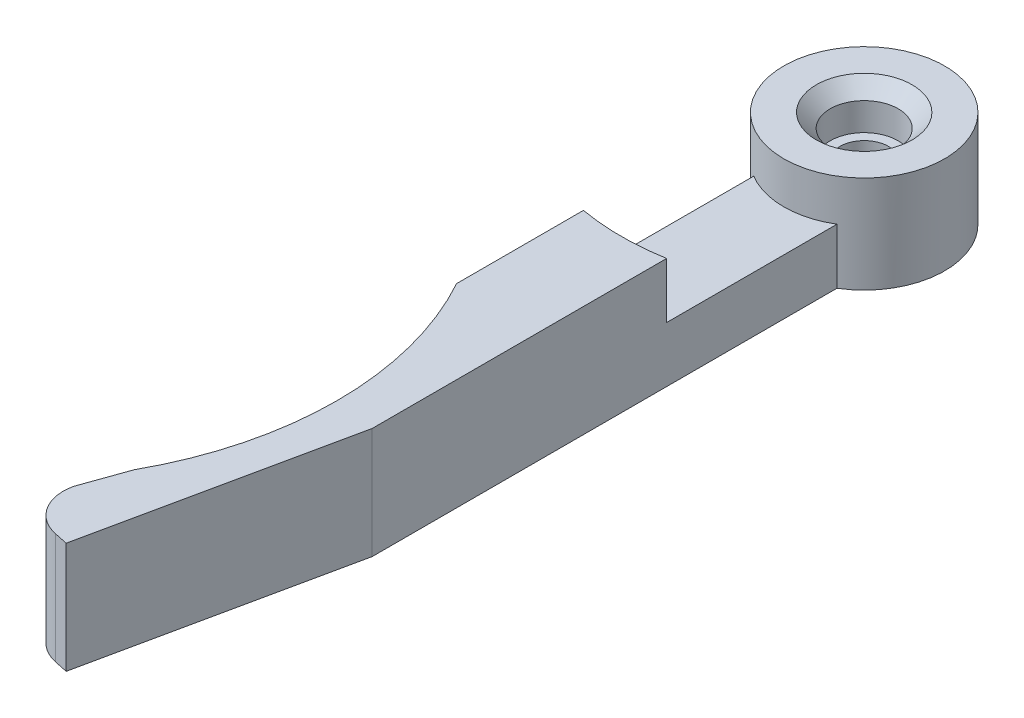
ISO-10303-21;
HEADER;
FILE_DESCRIPTION(('STEP AP214'),'2;1');
FILE_NAME('part.step','',(''),(''),'','','');
FILE_SCHEMA(('AUTOMOTIVE_DESIGN { 1 0 10303 214 1 1 1 1 }'));
ENDSEC;
DATA;
#1=APPLICATION_CONTEXT('core data for automotive mechanical design processes');
#2=APPLICATION_PROTOCOL_DEFINITION('international standard','automotive_design',2000,#1);
#3=PRODUCT_CONTEXT('',#1,'mechanical');
#4=PRODUCT('Part','Part','',(#3));
#5=PRODUCT_RELATED_PRODUCT_CATEGORY('part','',(#4));
#6=PRODUCT_DEFINITION_FORMATION('','',#4);
#7=PRODUCT_DEFINITION_CONTEXT('part definition',#1,'design');
#8=PRODUCT_DEFINITION('design','',#6,#7);
#9=PRODUCT_DEFINITION_SHAPE('','',#8);
#10=(LENGTH_UNIT() NAMED_UNIT(*) SI_UNIT(.MILLI.,.METRE.));
#11=(NAMED_UNIT(*) PLANE_ANGLE_UNIT() SI_UNIT($,.RADIAN.));
#12=(NAMED_UNIT(*) SI_UNIT($,.STERADIAN.) SOLID_ANGLE_UNIT());
#13=UNCERTAINTY_MEASURE_WITH_UNIT(LENGTH_MEASURE(1.E-05),#10,'distance_accuracy_value','');
#14=(GEOMETRIC_REPRESENTATION_CONTEXT(3) GLOBAL_UNCERTAINTY_ASSIGNED_CONTEXT((#13)) GLOBAL_UNIT_ASSIGNED_CONTEXT((#10,
#11,#12)) REPRESENTATION_CONTEXT('',''));
#15=CARTESIAN_POINT('',(0.,0.,0.));
#16=DIRECTION('',(0.,0.,1.));
#17=DIRECTION('',(1.,0.,0.));
#18=AXIS2_PLACEMENT_3D('',#15,#16,#17);
#19=CARTESIAN_POINT('',(0.,8.,0.));
#20=DIRECTION('',(0.,-1.,0.));
#21=DIRECTION('',(0.,0.,1.));
#22=AXIS2_PLACEMENT_3D('',#19,#20,#21);
#23=CYLINDRICAL_SURFACE('',#22,5.8);
#24=DIRECTION('',(0.,-1.,0.));
#25=VECTOR('',#24,1.);
#26=CARTESIAN_POINT('',(2.99999999999999,8.,4.96386945839635));
#27=LINE('',#26,#25);
#28=CARTESIAN_POINT('',(2.99999999999999,4.,4.96386945839635));
#29=VERTEX_POINT('',#28);
#30=CARTESIAN_POINT('',(2.99999999999999,0.,4.96386945839635));
#31=VERTEX_POINT('',#30);
#32=EDGE_CURVE('E181',#29,#31,#27,.T.);
#33=ORIENTED_EDGE('',*,*,#32,.T.);
#34=CARTESIAN_POINT('',(0.,0.,0.));
#35=DIRECTION('',(0.,-1.,0.));
#36=DIRECTION('',(0.,0.,-1.));
#37=AXIS2_PLACEMENT_3D('',#34,#35,#36);
#38=CIRCLE('',#37,5.8);
#39=CARTESIAN_POINT('',(-2.99999999999999,0.,4.96386945839635));
#40=VERTEX_POINT('',#39);
#41=EDGE_CURVE('E150',#40,#31,#38,.T.);
#42=ORIENTED_EDGE('',*,*,#41,.F.);
#43=DIRECTION('',(0.,-1.,0.));
#44=VECTOR('',#43,1.);
#45=CARTESIAN_POINT('',(-2.99999999999999,8.,4.96386945839635));
#46=LINE('',#45,#44);
#47=CARTESIAN_POINT('',(-2.99999999999999,4.,4.96386945839635));
#48=VERTEX_POINT('',#47);
#49=EDGE_CURVE('E149',#48,#40,#46,.T.);
#50=ORIENTED_EDGE('',*,*,#49,.F.);
#51=CARTESIAN_POINT('',(0.,4.,0.));
#52=DIRECTION('',(0.,1.,0.));
#53=DIRECTION('',(0.,0.,1.));
#54=AXIS2_PLACEMENT_3D('',#51,#52,#53);
#55=CIRCLE('',#54,5.80000000000002);
#56=EDGE_CURVE('E269',#48,#29,#55,.T.);
#57=ORIENTED_EDGE('',*,*,#56,.T.);
#58=EDGE_LOOP('',(#33,#42,#50,#57));
#59=FACE_BOUND('',#58,.T.);
#60=CARTESIAN_POINT('',(0.,7.,0.));
#61=DIRECTION('',(0.,1.,0.));
#62=DIRECTION('',(0.,0.,1.));
#63=AXIS2_PLACEMENT_3D('',#60,#61,#62);
#64=CIRCLE('',#63,5.8);
#65=CARTESIAN_POINT('',(0.,7.,5.8));
#66=VERTEX_POINT('',#65);
#67=EDGE_CURVE('E292',#66,#66,#64,.T.);
#68=ORIENTED_EDGE('',*,*,#67,.F.);
#69=EDGE_LOOP('',(#68));
#70=FACE_BOUND('',#69,.T.);
#71=ADVANCED_FACE('F41',(#59,#70),#23,.T.);
#72=CARTESIAN_POINT('',(0.,4.,0.));
#73=DIRECTION('',(0.,1.,0.));
#74=DIRECTION('',(0.,0.,-1.));
#75=AXIS2_PLACEMENT_3D('',#72,#73,#74);
#76=CYLINDRICAL_SURFACE('',#75,2.45);
#77=CARTESIAN_POINT('',(0.,5.99999999999999,0.));
#78=DIRECTION('',(0.,1.,0.));
#79=DIRECTION('',(0.,0.,1.));
#80=AXIS2_PLACEMENT_3D('',#77,#78,#79);
#81=CIRCLE('',#80,2.45);
#82=CARTESIAN_POINT('',(0.,5.99999999999999,2.44999999999998));
#83=VERTEX_POINT('',#82);
#84=EDGE_CURVE('E11',#83,#83,#81,.T.);
#85=ORIENTED_EDGE('',*,*,#84,.T.);
#86=EDGE_LOOP('',(#85));
#87=FACE_BOUND('',#86,.T.);
#88=CARTESIAN_POINT('',(0.,4.,0.));
#89=DIRECTION('',(0.,-1.,0.));
#90=DIRECTION('',(0.,0.,-1.));
#91=AXIS2_PLACEMENT_3D('',#88,#89,#90);
#92=CIRCLE('',#91,2.45);
#93=CARTESIAN_POINT('',(0.,4.,-2.45000000000002));
#94=VERTEX_POINT('',#93);
#95=EDGE_CURVE('E153',#94,#94,#92,.T.);
#96=ORIENTED_EDGE('',*,*,#95,.T.);
#97=EDGE_LOOP('',(#96));
#98=FACE_BOUND('',#97,.T.);
#99=ADVANCED_FACE('F203',(#87,#98),#76,.F.);
#100=CARTESIAN_POINT('',(0.,-0.00100000000000013,0.));
#101=DIRECTION('',(0.,1.,0.));
#102=DIRECTION('',(0.,0.,-1.));
#103=AXIS2_PLACEMENT_3D('',#100,#101,#102);
#104=CYLINDRICAL_SURFACE('',#103,1.75);
#105=CARTESIAN_POINT('',(0.,4.,0.));
#106=DIRECTION('',(0.,-1.,0.));
#107=DIRECTION('',(0.,0.,-1.));
#108=AXIS2_PLACEMENT_3D('',#105,#106,#107);
#109=CIRCLE('',#108,1.75);
#110=CARTESIAN_POINT('',(0.,4.,-1.75000000000002));
#111=VERTEX_POINT('',#110);
#112=EDGE_CURVE('E186',#111,#111,#109,.T.);
#113=ORIENTED_EDGE('',*,*,#112,.F.);
#114=EDGE_LOOP('',(#113));
#115=FACE_BOUND('',#114,.T.);
#116=CARTESIAN_POINT('',(0.,2.5,0.));
#117=DIRECTION('',(0.,1.,0.));
#118=DIRECTION('',(0.,0.,1.));
#119=AXIS2_PLACEMENT_3D('',#116,#117,#118);
#120=CIRCLE('',#119,1.75);
#121=CARTESIAN_POINT('',(0.,2.5,1.74999999999998));
#122=VERTEX_POINT('',#121);
#123=EDGE_CURVE('E184',#122,#122,#120,.F.);
#124=ORIENTED_EDGE('',*,*,#123,.T.);
#125=EDGE_LOOP('',(#124));
#126=FACE_BOUND('',#125,.T.);
#127=ADVANCED_FACE('F208',(#115,#126),#104,.F.);
#128=CARTESIAN_POINT('',(3.,8.,38.4638694583963));
#129=DIRECTION('',(-1.,0.,0.));
#130=DIRECTION('',(0.,0.,-1.));
#131=AXIS2_PLACEMENT_3D('',#128,#129,#130);
#132=PLANE('',#131);
#133=DIRECTION('',(0.,0.,1.));
#134=VECTOR('',#133,1.);
#135=CARTESIAN_POINT('',(3.,8.,38.4638694583963));
#136=LINE('',#135,#134);
#137=CARTESIAN_POINT('',(3.,8.,17.2409396495667));
#138=VERTEX_POINT('',#137);
#139=CARTESIAN_POINT('',(3.,8.,38.4638694583963));
#140=VERTEX_POINT('',#139);
#141=EDGE_CURVE('E168',#138,#140,#136,.T.);
#142=ORIENTED_EDGE('',*,*,#141,.T.);
#143=DIRECTION('',(0.,-1.,0.));
#144=VECTOR('',#143,1.);
#145=CARTESIAN_POINT('',(3.,8.,38.4638694583963));
#146=LINE('',#145,#144);
#147=CARTESIAN_POINT('',(3.,0.,38.4638694583963));
#148=VERTEX_POINT('',#147);
#149=EDGE_CURVE('E178',#140,#148,#146,.T.);
#150=ORIENTED_EDGE('',*,*,#149,.T.);
#151=DIRECTION('',(0.,0.,1.));
#152=VECTOR('',#151,1.);
#153=CARTESIAN_POINT('',(3.,0.,38.4638694583963));
#154=LINE('',#153,#152);
#155=EDGE_CURVE('E152',#31,#148,#154,.T.);
#156=ORIENTED_EDGE('',*,*,#155,.F.);
#157=ORIENTED_EDGE('',*,*,#32,.F.);
#158=DIRECTION('',(0.,0.,1.));
#159=VECTOR('',#158,1.);
#160=CARTESIAN_POINT('',(2.99999999999999,4.,4.96386945839635));
#161=LINE('',#160,#159);
#162=CARTESIAN_POINT('',(2.99999999999999,4.,17.2409396495667));
#163=VERTEX_POINT('',#162);
#164=EDGE_CURVE('E277',#29,#163,#161,.T.);
#165=ORIENTED_EDGE('',*,*,#164,.T.);
#166=DIRECTION('',(0.,1.,0.));
#167=VECTOR('',#166,1.);
#168=CARTESIAN_POINT('',(2.99999999999999,4.,17.2409396495667));
#169=LINE('',#168,#167);
#170=EDGE_CURVE('E283',#163,#138,#169,.T.);
#171=ORIENTED_EDGE('',*,*,#170,.T.);
#172=EDGE_LOOP('',(#142,#150,#156,#157,#165,#171));
#173=FACE_BOUND('',#172,.T.);
#174=ADVANCED_FACE('F213',(#173),#132,.F.);
#175=CARTESIAN_POINT('',(-0.867157449210331,8.,56.6574148320451));
#176=DIRECTION('',(-0.978147600733806,0.,-0.20791169081776));
#177=DIRECTION('',(0.20791169081776,0.,-0.978147600733806));
#178=AXIS2_PLACEMENT_3D('',#175,#176,#177);
#179=PLANE('',#178);
#180=DIRECTION('',(-0.20791169081776,0.,0.978147600733805));
#181=VECTOR('',#180,1.);
#182=CARTESIAN_POINT('',(-0.867157449210331,0.,56.6574148320451));
#183=LINE('',#182,#181);
#184=CARTESIAN_POINT('',(-0.867157449210331,0.,56.6574148320451));
#185=VERTEX_POINT('',#184);
#186=EDGE_CURVE('E156',#148,#185,#183,.T.);
#187=ORIENTED_EDGE('',*,*,#186,.F.);
#188=ORIENTED_EDGE('',*,*,#149,.F.);
#189=DIRECTION('',(-0.20791169081776,0.,0.978147600733805));
#190=VECTOR('',#189,1.);
#191=CARTESIAN_POINT('',(-0.867157449210331,8.,56.6574148320451));
#192=LINE('',#191,#190);
#193=CARTESIAN_POINT('',(-0.867157449210331,8.,56.6574148320451));
#194=VERTEX_POINT('',#193);
#195=EDGE_CURVE('E106',#140,#194,#192,.T.);
#196=ORIENTED_EDGE('',*,*,#195,.T.);
#197=DIRECTION('',(0.,-1.,0.));
#198=VECTOR('',#197,1.);
#199=CARTESIAN_POINT('',(-0.867157449210331,8.,56.6574148320451));
#200=LINE('',#199,#198);
#201=EDGE_CURVE('E175',#194,#185,#200,.T.);
#202=ORIENTED_EDGE('',*,*,#201,.T.);
#203=EDGE_LOOP('',(#187,#188,#196,#202));
#204=FACE_BOUND('',#203,.T.);
#205=ADVANCED_FACE('F216',(#204),#179,.F.);
#206=CARTESIAN_POINT('',(-1.84530504994414,8.,56.4495031412274));
#207=DIRECTION('',(0.207911690817762,0.,-0.978147600733805));
#208=DIRECTION('',(0.978147600733805,0.,0.207911690817762));
#209=AXIS2_PLACEMENT_3D('',#206,#207,#208);
#210=PLANE('',#209);
#211=DIRECTION('',(-0.978147600733805,0.,-0.207911690817762));
#212=VECTOR('',#211,1.);
#213=CARTESIAN_POINT('',(-1.84530504994414,0.,56.4495031412274));
#214=LINE('',#213,#212);
#215=CARTESIAN_POINT('',(-1.84530504994414,0.,56.4495031412274));
#216=VERTEX_POINT('',#215);
#217=EDGE_CURVE('E159',#185,#216,#214,.T.);
#218=ORIENTED_EDGE('',*,*,#217,.F.);
#219=ORIENTED_EDGE('',*,*,#201,.F.);
#220=DIRECTION('',(-0.978147600733805,0.,-0.207911690817762));
#221=VECTOR('',#220,1.);
#222=CARTESIAN_POINT('',(-1.84530504994414,8.,56.4495031412274));
#223=LINE('',#222,#221);
#224=CARTESIAN_POINT('',(-1.84530504994414,8.,56.4495031412274));
#225=VERTEX_POINT('',#224);
#226=EDGE_CURVE('E142',#194,#225,#223,.T.);
#227=ORIENTED_EDGE('',*,*,#226,.T.);
#228=DIRECTION('',(0.,-1.,0.));
#229=VECTOR('',#228,1.);
#230=CARTESIAN_POINT('',(-1.84530504994414,8.,56.4495031412274));
#231=LINE('',#230,#229);
#232=EDGE_CURVE('E136',#225,#216,#231,.T.);
#233=ORIENTED_EDGE('',*,*,#232,.T.);
#234=EDGE_LOOP('',(#218,#219,#227,#233));
#235=FACE_BOUND('',#234,.T.);
#236=ADVANCED_FACE('F220',(#235),#210,.F.);
#237=CARTESIAN_POINT('',(-1.22156997749086,8.,53.515060339026));
#238=DIRECTION('',(0.,-1.,0.));
#239=DIRECTION('',(0.,0.,1.));
#240=AXIS2_PLACEMENT_3D('',#237,#238,#239);
#241=CYLINDRICAL_SURFACE('',#240,3.);
#242=CARTESIAN_POINT('',(-1.22156997749086,0.,53.515060339026));
#243=DIRECTION('',(0.,-1.,0.));
#244=DIRECTION('',(0.,0.,1.));
#245=AXIS2_PLACEMENT_3D('',#242,#243,#244);
#246=CIRCLE('',#245,3.);
#247=CARTESIAN_POINT('',(-4.14041417555798,0.,52.8219885192194));
#248=VERTEX_POINT('',#247);
#249=EDGE_CURVE('E162',#216,#248,#246,.T.);
#250=ORIENTED_EDGE('',*,*,#249,.F.);
#251=ORIENTED_EDGE('',*,*,#232,.F.);
#252=CARTESIAN_POINT('',(-1.22156997749086,8.,53.515060339026));
#253=DIRECTION('',(0.,-1.,0.));
#254=DIRECTION('',(0.,0.,1.));
#255=AXIS2_PLACEMENT_3D('',#252,#253,#254);
#256=CIRCLE('',#255,3.);
#257=CARTESIAN_POINT('',(-4.14041417555798,8.,52.8219885192194));
#258=VERTEX_POINT('',#257);
#259=EDGE_CURVE('E121',#225,#258,#256,.T.);
#260=ORIENTED_EDGE('',*,*,#259,.T.);
#261=DIRECTION('',(0.,-1.,0.));
#262=VECTOR('',#261,1.);
#263=CARTESIAN_POINT('',(-4.14041417555798,8.,52.8219885192194));
#264=LINE('',#263,#262);
#265=EDGE_CURVE('E130',#258,#248,#264,.T.);
#266=ORIENTED_EDGE('',*,*,#265,.T.);
#267=EDGE_LOOP('',(#250,#251,#260,#266));
#268=FACE_BOUND('',#267,.T.);
#269=ADVANCED_FACE('F139',(#268),#241,.T.);
#270=CARTESIAN_POINT('',(-4.14041417555798,8.,52.8219885192194));
#271=DIRECTION('',(0.942070141352118,0.,0.33541593398764));
#272=DIRECTION('',(-0.33541593398764,0.,0.942070141352118));
#273=AXIS2_PLACEMENT_3D('',#270,#271,#272);
#274=PLANE('',#273);
#275=DIRECTION('',(0.33541593398764,0.,-0.942070141352118));
#276=VECTOR('',#275,1.);
#277=CARTESIAN_POINT('',(-4.14041417555798,0.,52.8219885192194));
#278=LINE('',#277,#276);
#279=CARTESIAN_POINT('',(-3.,0.,49.6189500386222));
#280=VERTEX_POINT('',#279);
#281=EDGE_CURVE('E133',#248,#280,#278,.T.);
#282=ORIENTED_EDGE('',*,*,#281,.F.);
#283=ORIENTED_EDGE('',*,*,#265,.F.);
#284=DIRECTION('',(0.33541593398764,0.,-0.942070141352118));
#285=VECTOR('',#284,1.);
#286=CARTESIAN_POINT('',(-4.14041417555798,8.,52.8219885192194));
#287=LINE('',#286,#285);
#288=CARTESIAN_POINT('',(-3.,8.,49.6189500386222));
#289=VERTEX_POINT('',#288);
#290=EDGE_CURVE('E117',#258,#289,#287,.T.);
#291=ORIENTED_EDGE('',*,*,#290,.T.);
#292=DIRECTION('',(0.,-1.,0.));
#293=VECTOR('',#292,1.);
#294=CARTESIAN_POINT('',(-3.,8.,49.6189500386222));
#295=LINE('',#294,#293);
#296=EDGE_CURVE('E137',#289,#280,#295,.T.);
#297=ORIENTED_EDGE('',*,*,#296,.T.);
#298=EDGE_LOOP('',(#282,#283,#291,#297));
#299=FACE_BOUND('',#298,.T.);
#300=ADVANCED_FACE('F131',(#299),#274,.F.);
#301=CARTESIAN_POINT('',(-24.,8.,38.));
#302=DIRECTION('',(0.,-1.,0.));
#303=DIRECTION('',(0.,0.,1.));
#304=AXIS2_PLACEMENT_3D('',#301,#302,#303);
#305=CYLINDRICAL_SURFACE('',#304,24.);
#306=CARTESIAN_POINT('',(-24.,0.,38.));
#307=DIRECTION('',(0.,1.,0.));
#308=DIRECTION('',(0.,0.,1.));
#309=AXIS2_PLACEMENT_3D('',#306,#307,#308);
#310=CIRCLE('',#309,24.);
#311=CARTESIAN_POINT('',(-2.99999999999999,0.,26.3810499613777));
#312=VERTEX_POINT('',#311);
#313=EDGE_CURVE('E165',#280,#312,#310,.T.);
#314=ORIENTED_EDGE('',*,*,#313,.F.);
#315=ORIENTED_EDGE('',*,*,#296,.F.);
#316=CARTESIAN_POINT('',(-24.,8.,38.));
#317=DIRECTION('',(0.,1.,0.));
#318=DIRECTION('',(0.,0.,1.));
#319=AXIS2_PLACEMENT_3D('',#316,#317,#318);
#320=CIRCLE('',#319,24.);
#321=CARTESIAN_POINT('',(-2.99999999999999,8.,26.3810499613777));
#322=VERTEX_POINT('',#321);
#323=EDGE_CURVE('E124',#289,#322,#320,.T.);
#324=ORIENTED_EDGE('',*,*,#323,.T.);
#325=DIRECTION('',(0.,-1.,0.));
#326=VECTOR('',#325,1.);
#327=CARTESIAN_POINT('',(-2.99999999999999,8.,26.3810499613777));
#328=LINE('',#327,#326);
#329=EDGE_CURVE('E170',#322,#312,#328,.T.);
#330=ORIENTED_EDGE('',*,*,#329,.T.);
#331=EDGE_LOOP('',(#314,#315,#324,#330));
#332=FACE_BOUND('',#331,.T.);
#333=ADVANCED_FACE('F229',(#332),#305,.F.);
#334=CARTESIAN_POINT('',(-2.99999999999999,8.,26.3810499613777));
#335=DIRECTION('',(1.,0.,0.));
#336=DIRECTION('',(0.,0.,1.));
#337=AXIS2_PLACEMENT_3D('',#334,#335,#336);
#338=PLANE('',#337);
#339=DIRECTION('',(0.,0.,-1.));
#340=VECTOR('',#339,1.);
#341=CARTESIAN_POINT('',(-2.99999999999999,4.,4.96386945839635));
#342=LINE('',#341,#340);
#343=CARTESIAN_POINT('',(-2.99999999999999,4.,17.2409396495666));
#344=VERTEX_POINT('',#343);
#345=EDGE_CURVE('E274',#344,#48,#342,.T.);
#346=ORIENTED_EDGE('',*,*,#345,.T.);
#347=ORIENTED_EDGE('',*,*,#49,.T.);
#348=DIRECTION('',(0.,0.,-1.));
#349=VECTOR('',#348,1.);
#350=CARTESIAN_POINT('',(-2.99999999999999,0.,26.3810499613777));
#351=LINE('',#350,#349);
#352=EDGE_CURVE('E98',#312,#40,#351,.T.);
#353=ORIENTED_EDGE('',*,*,#352,.F.);
#354=ORIENTED_EDGE('',*,*,#329,.F.);
#355=DIRECTION('',(0.,0.,-1.));
#356=VECTOR('',#355,1.);
#357=CARTESIAN_POINT('',(-2.99999999999999,8.,26.3810499613777));
#358=LINE('',#357,#356);
#359=CARTESIAN_POINT('',(-2.99999999999999,8.,17.2409396495666));
#360=VERTEX_POINT('',#359);
#361=EDGE_CURVE('E65',#322,#360,#358,.T.);
#362=ORIENTED_EDGE('',*,*,#361,.T.);
#363=DIRECTION('',(0.,1.,0.));
#364=VECTOR('',#363,1.);
#365=CARTESIAN_POINT('',(-2.99999999999999,4.,17.2409396495666));
#366=LINE('',#365,#364);
#367=EDGE_CURVE('E282',#344,#360,#366,.T.);
#368=ORIENTED_EDGE('',*,*,#367,.F.);
#369=EDGE_LOOP('',(#346,#347,#353,#354,#362,#368));
#370=FACE_BOUND('',#369,.T.);
#371=ADVANCED_FACE('F232',(#370),#338,.F.);
#372=CARTESIAN_POINT('',(0.,8.,0.));
#373=DIRECTION('',(0.,1.,0.));
#374=DIRECTION('',(0.,0.,-1.));
#375=AXIS2_PLACEMENT_3D('',#372,#373,#374);
#376=PLANE('',#375);
#377=CARTESIAN_POINT('',(0.,8.,0.));
#378=DIRECTION('',(0.,-1.,0.));
#379=DIRECTION('',(0.,0.,1.));
#380=AXIS2_PLACEMENT_3D('',#377,#378,#379);
#381=CIRCLE('',#380,17.5);
#382=EDGE_CURVE('E57',#138,#360,#381,.T.);
#383=ORIENTED_EDGE('',*,*,#382,.T.);
#384=ORIENTED_EDGE('',*,*,#361,.F.);
#385=ORIENTED_EDGE('',*,*,#323,.F.);
#386=ORIENTED_EDGE('',*,*,#290,.F.);
#387=ORIENTED_EDGE('',*,*,#259,.F.);
#388=ORIENTED_EDGE('',*,*,#226,.F.);
#389=ORIENTED_EDGE('',*,*,#195,.F.);
#390=ORIENTED_EDGE('',*,*,#141,.F.);
#391=EDGE_LOOP('',(#383,#384,#385,#386,#387,#388,#389,#390));
#392=FACE_BOUND('',#391,.T.);
#393=ADVANCED_FACE('F119',(#392),#376,.T.);
#394=CARTESIAN_POINT('',(0.,0.,0.));
#395=DIRECTION('',(0.,1.,0.));
#396=DIRECTION('',(0.,0.,-1.));
#397=AXIS2_PLACEMENT_3D('',#394,#395,#396);
#398=PLANE('',#397);
#399=CARTESIAN_POINT('',(0.,0.,0.));
#400=DIRECTION('',(0.,1.,0.));
#401=DIRECTION('',(0.,0.,1.));
#402=AXIS2_PLACEMENT_3D('',#399,#400,#401);
#403=CIRCLE('',#402,3.75);
#404=CARTESIAN_POINT('',(0.,0.,3.74999999999998));
#405=VERTEX_POINT('',#404);
#406=EDGE_CURVE('E293',#405,#405,#403,.T.);
#407=ORIENTED_EDGE('',*,*,#406,.T.);
#408=EDGE_LOOP('',(#407));
#409=FACE_BOUND('',#408,.T.);
#410=ORIENTED_EDGE('',*,*,#41,.T.);
#411=ORIENTED_EDGE('',*,*,#155,.T.);
#412=ORIENTED_EDGE('',*,*,#186,.T.);
#413=ORIENTED_EDGE('',*,*,#217,.T.);
#414=ORIENTED_EDGE('',*,*,#249,.T.);
#415=ORIENTED_EDGE('',*,*,#281,.T.);
#416=ORIENTED_EDGE('',*,*,#313,.T.);
#417=ORIENTED_EDGE('',*,*,#352,.T.);
#418=EDGE_LOOP('',(#410,#411,#412,#413,#414,#415,#416,#417));
#419=FACE_BOUND('',#418,.T.);
#420=ADVANCED_FACE('F237',(#409,#419),#398,.F.);
#421=CARTESIAN_POINT('',(0.,4.,0.));
#422=DIRECTION('',(0.,1.,0.));
#423=DIRECTION('',(0.,0.,-1.));
#424=AXIS2_PLACEMENT_3D('',#421,#422,#423);
#425=PLANE('',#424);
#426=ORIENTED_EDGE('',*,*,#112,.T.);
#427=EDGE_LOOP('',(#426));
#428=FACE_BOUND('',#427,.T.);
#429=ORIENTED_EDGE('',*,*,#95,.F.);
#430=EDGE_LOOP('',(#429));
#431=FACE_BOUND('',#430,.T.);
#432=ADVANCED_FACE('F240',(#428,#431),#425,.T.);
#433=CARTESIAN_POINT('',(0.,2.5,0.));
#434=DIRECTION('',(0.,-1.,0.));
#435=DIRECTION('',(0.,0.,1.));
#436=AXIS2_PLACEMENT_3D('',#433,#434,#435);
#437=PLANE('',#436);
#438=CARTESIAN_POINT('',(0.,2.5,0.));
#439=DIRECTION('',(0.,1.,0.));
#440=DIRECTION('',(0.,0.,1.));
#441=AXIS2_PLACEMENT_3D('',#438,#439,#440);
#442=CIRCLE('',#441,3.75);
#443=CARTESIAN_POINT('',(0.,2.5,3.74999999999998));
#444=VERTEX_POINT('',#443);
#445=EDGE_CURVE('E187',#444,#444,#442,.T.);
#446=ORIENTED_EDGE('',*,*,#445,.F.);
#447=EDGE_LOOP('',(#446));
#448=FACE_BOUND('',#447,.T.);
#449=ORIENTED_EDGE('',*,*,#123,.F.);
#450=EDGE_LOOP('',(#449));
#451=FACE_BOUND('',#450,.T.);
#452=ADVANCED_FACE('F246',(#448,#451),#437,.T.);
#453=CARTESIAN_POINT('',(0.,2.5,0.));
#454=DIRECTION('',(0.,-1.,0.));
#455=DIRECTION('',(0.,0.,1.));
#456=AXIS2_PLACEMENT_3D('',#453,#454,#455);
#457=CYLINDRICAL_SURFACE('',#456,3.75);
#458=ORIENTED_EDGE('',*,*,#445,.T.);
#459=EDGE_LOOP('',(#458));
#460=FACE_BOUND('',#459,.T.);
#461=ORIENTED_EDGE('',*,*,#406,.F.);
#462=EDGE_LOOP('',(#461));
#463=FACE_BOUND('',#462,.T.);
#464=ADVANCED_FACE('F251',(#460,#463),#457,.F.);
#465=CARTESIAN_POINT('',(0.,4.,0.));
#466=DIRECTION('',(0.,1.,0.));
#467=DIRECTION('',(0.,0.,-1.));
#468=AXIS2_PLACEMENT_3D('',#465,#466,#467);
#469=CYLINDRICAL_SURFACE('',#468,17.5);
#470=ORIENTED_EDGE('',*,*,#382,.F.);
#471=ORIENTED_EDGE('',*,*,#170,.F.);
#472=CARTESIAN_POINT('',(0.,4.,0.));
#473=DIRECTION('',(0.,-1.,0.));
#474=DIRECTION('',(0.,0.,1.));
#475=AXIS2_PLACEMENT_3D('',#472,#473,#474);
#476=CIRCLE('',#475,17.5);
#477=EDGE_CURVE('E284',#163,#344,#476,.T.);
#478=ORIENTED_EDGE('',*,*,#477,.T.);
#479=ORIENTED_EDGE('',*,*,#367,.T.);
#480=EDGE_LOOP('',(#470,#471,#478,#479));
#481=FACE_BOUND('',#480,.T.);
#482=ADVANCED_FACE('F254',(#481),#469,.F.);
#483=CARTESIAN_POINT('',(0.,4.,0.));
#484=DIRECTION('',(0.,-1.,0.));
#485=DIRECTION('',(0.,0.,1.));
#486=AXIS2_PLACEMENT_3D('',#483,#484,#485);
#487=PLANE('',#486);
#488=ORIENTED_EDGE('',*,*,#56,.F.);
#489=ORIENTED_EDGE('',*,*,#345,.F.);
#490=ORIENTED_EDGE('',*,*,#477,.F.);
#491=ORIENTED_EDGE('',*,*,#164,.F.);
#492=EDGE_LOOP('',(#488,#489,#490,#491));
#493=FACE_BOUND('',#492,.T.);
#494=ADVANCED_FACE('F199',(#493),#487,.F.);
#495=CARTESIAN_POINT('',(0.,7.,0.));
#496=DIRECTION('',(0.,1.,0.));
#497=DIRECTION('',(0.,0.,1.));
#498=AXIS2_PLACEMENT_3D('',#495,#496,#497);
#499=PLANE('',#498);
#500=CARTESIAN_POINT('',(0.,7.,0.));
#501=DIRECTION('',(0.,1.,0.));
#502=DIRECTION('',(0.,0.,1.));
#503=AXIS2_PLACEMENT_3D('',#500,#501,#502);
#504=CIRCLE('',#503,3.45000000000001);
#505=CARTESIAN_POINT('',(0.,7.,3.44999999999999));
#506=VERTEX_POINT('',#505);
#507=EDGE_CURVE('E50',#506,#506,#504,.F.);
#508=ORIENTED_EDGE('',*,*,#507,.T.);
#509=EDGE_LOOP('',(#508));
#510=FACE_BOUND('',#509,.T.);
#511=ORIENTED_EDGE('',*,*,#67,.T.);
#512=EDGE_LOOP('',(#511));
#513=FACE_BOUND('',#512,.T.);
#514=ADVANCED_FACE('F191',(#510,#513),#499,.T.);
#515=CARTESIAN_POINT('',(0.,7.,0.));
#516=DIRECTION('',(0.,1.,0.));
#517=DIRECTION('',(0.,0.,1.));
#518=AXIS2_PLACEMENT_3D('',#515,#516,#517);
#519=CONICAL_SURFACE('',#518,3.45000000000001,0.785398163397449);
#520=ORIENTED_EDGE('',*,*,#84,.F.);
#521=EDGE_LOOP('',(#520));
#522=FACE_BOUND('',#521,.T.);
#523=ORIENTED_EDGE('',*,*,#507,.F.);
#524=EDGE_LOOP('',(#523));
#525=FACE_BOUND('',#524,.T.);
#526=ADVANCED_FACE('F44',(#522,#525),#519,.F.);
#527=CLOSED_SHELL('',(#71,#99,#127,#174,#205,#236,#269,#300,#333,#371,#393,#420,#432,#452,#464,
#482,#494,#514,#526));
#528=MANIFOLD_SOLID_BREP('B2',#527);
#529=ADVANCED_BREP_SHAPE_REPRESENTATION('',(#18,#528),#14);
#530=SHAPE_DEFINITION_REPRESENTATION(#9,#529);
ENDSEC;
END-ISO-10303-21;
